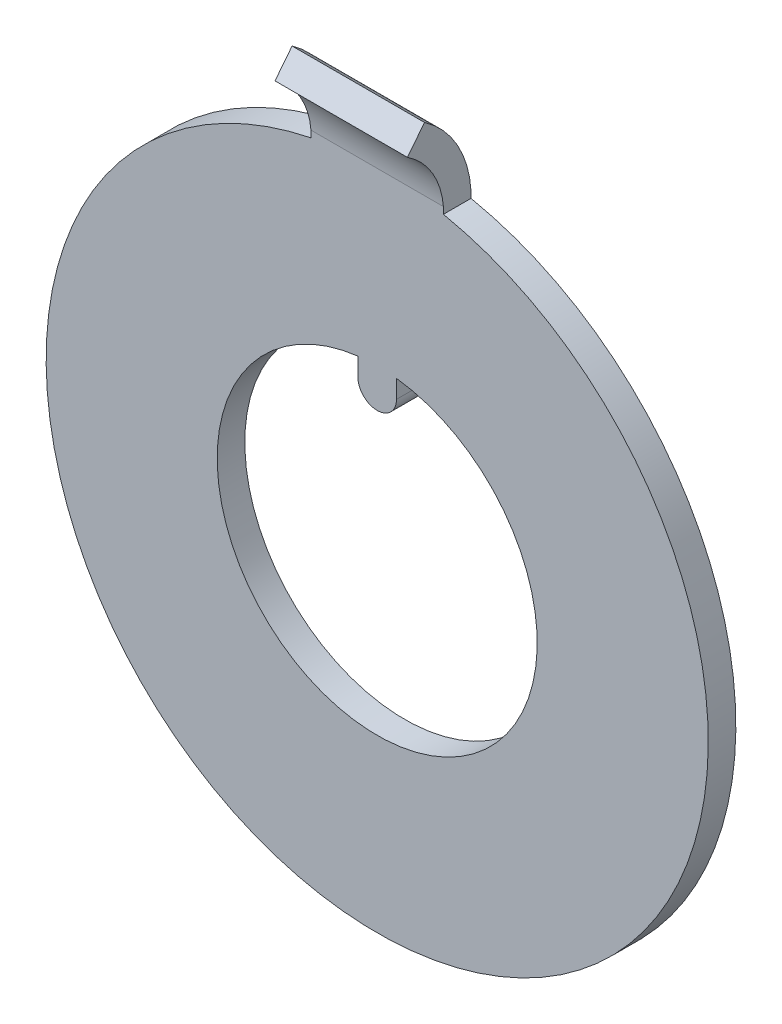
ISO-10303-21;
HEADER;
FILE_DESCRIPTION(('STEP AP214'),'2;1');
FILE_NAME('part.step','',(''),(''),'','','');
FILE_SCHEMA(('AUTOMOTIVE_DESIGN { 1 0 10303 214 1 1 1 1 }'));
ENDSEC;
DATA;
#1=APPLICATION_CONTEXT('core data for automotive mechanical design processes');
#2=APPLICATION_PROTOCOL_DEFINITION('international standard','automotive_design',2000,#1);
#3=PRODUCT_CONTEXT('',#1,'mechanical');
#4=PRODUCT('Part','Part','',(#3));
#5=PRODUCT_RELATED_PRODUCT_CATEGORY('part','',(#4));
#6=PRODUCT_DEFINITION_FORMATION('','',#4);
#7=PRODUCT_DEFINITION_CONTEXT('part definition',#1,'design');
#8=PRODUCT_DEFINITION('design','',#6,#7);
#9=PRODUCT_DEFINITION_SHAPE('','',#8);
#10=(LENGTH_UNIT() NAMED_UNIT(*) SI_UNIT(.MILLI.,.METRE.));
#11=(NAMED_UNIT(*) PLANE_ANGLE_UNIT() SI_UNIT($,.RADIAN.));
#12=(NAMED_UNIT(*) SI_UNIT($,.STERADIAN.) SOLID_ANGLE_UNIT());
#13=UNCERTAINTY_MEASURE_WITH_UNIT(LENGTH_MEASURE(1.E-05),#10,'distance_accuracy_value','');
#14=(GEOMETRIC_REPRESENTATION_CONTEXT(3) GLOBAL_UNCERTAINTY_ASSIGNED_CONTEXT((#13)) GLOBAL_UNIT_ASSIGNED_CONTEXT((#10,
#11,#12)) REPRESENTATION_CONTEXT('',''));
#15=CARTESIAN_POINT('',(0.,0.,0.));
#16=DIRECTION('',(0.,0.,1.));
#17=DIRECTION('',(1.,0.,0.));
#18=AXIS2_PLACEMENT_3D('',#15,#16,#17);
#19=CARTESIAN_POINT('',(-0.35,0.,0.5));
#20=DIRECTION('',(1.,0.,0.));
#21=DIRECTION('',(0.,1.,0.));
#22=AXIS2_PLACEMENT_3D('',#19,#20,#21);
#23=PLANE('',#22);
#24=DIRECTION('',(0.,-1.,0.));
#25=VECTOR('',#24,1.);
#26=CARTESIAN_POINT('',(-0.35,0.,0.));
#27=LINE('',#26,#25);
#28=CARTESIAN_POINT('',(-0.35,2.87880183409696,0.));
#29=VERTEX_POINT('',#28);
#30=CARTESIAN_POINT('',(-0.35,2.55,0.));
#31=VERTEX_POINT('',#30);
#32=EDGE_CURVE('E195',#29,#31,#27,.T.);
#33=ORIENTED_EDGE('',*,*,#32,.T.);
#34=DIRECTION('',(0.,0.,-1.));
#35=VECTOR('',#34,1.);
#36=CARTESIAN_POINT('',(-0.35,2.55,0.5));
#37=LINE('',#36,#35);
#38=CARTESIAN_POINT('',(-0.35,2.55,0.5));
#39=VERTEX_POINT('',#38);
#40=EDGE_CURVE('E11',#39,#31,#37,.T.);
#41=ORIENTED_EDGE('',*,*,#40,.F.);
#42=DIRECTION('',(0.,-1.,0.));
#43=VECTOR('',#42,1.);
#44=CARTESIAN_POINT('',(-0.35,0.,0.5));
#45=LINE('',#44,#43);
#46=CARTESIAN_POINT('',(-0.35,2.87880183409696,0.5));
#47=VERTEX_POINT('',#46);
#48=EDGE_CURVE('E196',#47,#39,#45,.T.);
#49=ORIENTED_EDGE('',*,*,#48,.F.);
#50=DIRECTION('',(0.,0.,-1.));
#51=VECTOR('',#50,1.);
#52=CARTESIAN_POINT('',(-0.35,2.87880183409696,0.5));
#53=LINE('',#52,#51);
#54=EDGE_CURVE('E65',#47,#29,#53,.T.);
#55=ORIENTED_EDGE('',*,*,#54,.T.);
#56=EDGE_LOOP('',(#33,#41,#49,#55));
#57=FACE_BOUND('',#56,.T.);
#58=ADVANCED_FACE('F41',(#57),#23,.F.);
#59=CARTESIAN_POINT('',(0.,2.55,0.5));
#60=DIRECTION('',(0.,0.,-1.));
#61=DIRECTION('',(-1.,0.,0.));
#62=AXIS2_PLACEMENT_3D('',#59,#60,#61);
#63=CYLINDRICAL_SURFACE('',#62,0.35);
#64=CARTESIAN_POINT('',(0.,2.55,0.));
#65=DIRECTION('',(0.,0.,1.));
#66=DIRECTION('',(1.,0.,0.));
#67=AXIS2_PLACEMENT_3D('',#64,#65,#66);
#68=CIRCLE('',#67,0.35);
#69=CARTESIAN_POINT('',(0.35,2.55,0.));
#70=VERTEX_POINT('',#69);
#71=EDGE_CURVE('E214',#31,#70,#68,.T.);
#72=ORIENTED_EDGE('',*,*,#71,.T.);
#73=DIRECTION('',(0.,0.,-1.));
#74=VECTOR('',#73,1.);
#75=CARTESIAN_POINT('',(0.35,2.55,0.5));
#76=LINE('',#75,#74);
#77=CARTESIAN_POINT('',(0.35,2.55,0.5));
#78=VERTEX_POINT('',#77);
#79=EDGE_CURVE('E49',#78,#70,#76,.T.);
#80=ORIENTED_EDGE('',*,*,#79,.F.);
#81=CARTESIAN_POINT('',(0.,2.55,0.5));
#82=DIRECTION('',(0.,0.,1.));
#83=DIRECTION('',(1.,0.,0.));
#84=AXIS2_PLACEMENT_3D('',#81,#82,#83);
#85=CIRCLE('',#84,0.35);
#86=EDGE_CURVE('E91',#39,#78,#85,.T.);
#87=ORIENTED_EDGE('',*,*,#86,.F.);
#88=ORIENTED_EDGE('',*,*,#40,.T.);
#89=EDGE_LOOP('',(#72,#80,#87,#88));
#90=FACE_BOUND('',#89,.T.);
#91=ADVANCED_FACE('F237',(#90),#63,.T.);
#92=CARTESIAN_POINT('',(0.35,0.,0.5));
#93=DIRECTION('',(1.,0.,0.));
#94=DIRECTION('',(0.,1.,0.));
#95=AXIS2_PLACEMENT_3D('',#92,#93,#94);
#96=PLANE('',#95);
#97=DIRECTION('',(0.,-1.,0.));
#98=VECTOR('',#97,1.);
#99=CARTESIAN_POINT('',(0.35,0.,0.));
#100=LINE('',#99,#98);
#101=CARTESIAN_POINT('',(0.35,2.87880183409696,0.));
#102=VERTEX_POINT('',#101);
#103=EDGE_CURVE('E218',#102,#70,#100,.T.);
#104=ORIENTED_EDGE('',*,*,#103,.F.);
#105=DIRECTION('',(0.,0.,-1.));
#106=VECTOR('',#105,1.);
#107=CARTESIAN_POINT('',(0.35,2.87880183409696,0.5));
#108=LINE('',#107,#106);
#109=CARTESIAN_POINT('',(0.35,2.87880183409696,0.5));
#110=VERTEX_POINT('',#109);
#111=EDGE_CURVE('E230',#110,#102,#108,.T.);
#112=ORIENTED_EDGE('',*,*,#111,.F.);
#113=DIRECTION('',(0.,-1.,0.));
#114=VECTOR('',#113,1.);
#115=CARTESIAN_POINT('',(0.35,0.,0.5));
#116=LINE('',#115,#114);
#117=EDGE_CURVE('E202',#110,#78,#116,.T.);
#118=ORIENTED_EDGE('',*,*,#117,.T.);
#119=ORIENTED_EDGE('',*,*,#79,.T.);
#120=EDGE_LOOP('',(#104,#112,#118,#119));
#121=FACE_BOUND('',#120,.T.);
#122=ADVANCED_FACE('F235',(#121),#96,.T.);
#123=CARTESIAN_POINT('',(0.,0.,0.5));
#124=DIRECTION('',(0.,0.,-1.));
#125=DIRECTION('',(-1.,0.,0.));
#126=AXIS2_PLACEMENT_3D('',#123,#124,#125);
#127=CYLINDRICAL_SURFACE('',#126,2.9);
#128=CARTESIAN_POINT('',(0.,0.,0.));
#129=DIRECTION('',(0.,0.,1.));
#130=DIRECTION('',(1.,0.,0.));
#131=AXIS2_PLACEMENT_3D('',#128,#129,#130);
#132=CIRCLE('',#131,2.9);
#133=EDGE_CURVE('E222',#29,#102,#132,.T.);
#134=ORIENTED_EDGE('',*,*,#133,.F.);
#135=ORIENTED_EDGE('',*,*,#54,.F.);
#136=CARTESIAN_POINT('',(0.,0.,0.5));
#137=DIRECTION('',(0.,0.,1.));
#138=DIRECTION('',(1.,0.,0.));
#139=AXIS2_PLACEMENT_3D('',#136,#137,#138);
#140=CIRCLE('',#139,2.9);
#141=EDGE_CURVE('E206',#47,#110,#140,.T.);
#142=ORIENTED_EDGE('',*,*,#141,.T.);
#143=ORIENTED_EDGE('',*,*,#111,.T.);
#144=EDGE_LOOP('',(#134,#135,#142,#143));
#145=FACE_BOUND('',#144,.T.);
#146=ADVANCED_FACE('F239',(#145),#127,.F.);
#147=CARTESIAN_POINT('',(0.,0.,0.5));
#148=DIRECTION('',(0.,0.,-1.));
#149=DIRECTION('',(-1.,0.,0.));
#150=AXIS2_PLACEMENT_3D('',#147,#148,#149);
#151=CYLINDRICAL_SURFACE('',#150,6.);
#152=CARTESIAN_POINT('',(0.,0.,0.5));
#153=DIRECTION('',(0.,0.,1.));
#154=DIRECTION('',(1.,0.,0.));
#155=AXIS2_PLACEMENT_3D('',#152,#153,#154);
#156=CIRCLE('',#155,6.);
#157=CARTESIAN_POINT('',(-1.2,5.87877538267963,0.5));
#158=VERTEX_POINT('',#157);
#159=CARTESIAN_POINT('',(1.2,5.87877538267963,0.5));
#160=VERTEX_POINT('',#159);
#161=EDGE_CURVE('E209',#158,#160,#156,.T.);
#162=ORIENTED_EDGE('',*,*,#161,.F.);
#163=DIRECTION('',(0.,0.,-1.));
#164=VECTOR('',#163,1.);
#165=CARTESIAN_POINT('',(-1.2,5.87877538267963,0.500000000000001));
#166=LINE('',#165,#164);
#167=CARTESIAN_POINT('',(-1.2,5.87877538267963,0.));
#168=VERTEX_POINT('',#167);
#169=EDGE_CURVE('E191',#158,#168,#166,.T.);
#170=ORIENTED_EDGE('',*,*,#169,.T.);
#171=CARTESIAN_POINT('',(0.,0.,0.));
#172=DIRECTION('',(0.,0.,1.));
#173=DIRECTION('',(1.,0.,0.));
#174=AXIS2_PLACEMENT_3D('',#171,#172,#173);
#175=CIRCLE('',#174,6.);
#176=CARTESIAN_POINT('',(1.2,5.87877538267963,0.));
#177=VERTEX_POINT('',#176);
#178=EDGE_CURVE('E199',#168,#177,#175,.T.);
#179=ORIENTED_EDGE('',*,*,#178,.T.);
#180=DIRECTION('',(0.,0.,-1.));
#181=VECTOR('',#180,1.);
#182=CARTESIAN_POINT('',(1.2,5.87877538267963,0.500000000000001));
#183=LINE('',#182,#181);
#184=EDGE_CURVE('E148',#177,#160,#183,.F.);
#185=ORIENTED_EDGE('',*,*,#184,.T.);
#186=EDGE_LOOP('',(#162,#170,#179,#185));
#187=FACE_BOUND('',#186,.T.);
#188=ADVANCED_FACE('F254',(#187),#151,.T.);
#189=CARTESIAN_POINT('',(0.,0.,0.5));
#190=DIRECTION('',(0.,0.,1.));
#191=DIRECTION('',(1.,0.,0.));
#192=AXIS2_PLACEMENT_3D('',#189,#190,#191);
#193=PLANE('',#192);
#194=ORIENTED_EDGE('',*,*,#161,.T.);
#195=DIRECTION('',(0.,1.,0.));
#196=VECTOR('',#195,1.);
#197=CARTESIAN_POINT('',(1.2,5.7,0.5));
#198=LINE('',#197,#196);
#199=CARTESIAN_POINT('',(1.2,6.,0.5));
#200=VERTEX_POINT('',#199);
#201=EDGE_CURVE('E150',#160,#200,#198,.T.);
#202=ORIENTED_EDGE('',*,*,#201,.T.);
#203=DIRECTION('',(1.,0.,0.));
#204=VECTOR('',#203,1.);
#205=CARTESIAN_POINT('',(1.2,6.,0.5));
#206=LINE('',#205,#204);
#207=CARTESIAN_POINT('',(-1.2,6.,0.5));
#208=VERTEX_POINT('',#207);
#209=EDGE_CURVE('E140',#208,#200,#206,.T.);
#210=ORIENTED_EDGE('',*,*,#209,.F.);
#211=DIRECTION('',(0.,1.,0.));
#212=VECTOR('',#211,1.);
#213=CARTESIAN_POINT('',(-1.2,5.7,0.5));
#214=LINE('',#213,#212);
#215=EDGE_CURVE('E56',#158,#208,#214,.T.);
#216=ORIENTED_EDGE('',*,*,#215,.F.);
#217=EDGE_LOOP('',(#194,#202,#210,#216));
#218=FACE_BOUND('',#217,.T.);
#219=ORIENTED_EDGE('',*,*,#48,.T.);
#220=ORIENTED_EDGE('',*,*,#86,.T.);
#221=ORIENTED_EDGE('',*,*,#117,.F.);
#222=ORIENTED_EDGE('',*,*,#141,.F.);
#223=EDGE_LOOP('',(#219,#220,#221,#222));
#224=FACE_BOUND('',#223,.T.);
#225=ADVANCED_FACE('F242',(#218,#224),#193,.T.);
#226=CARTESIAN_POINT('',(0.,0.,0.));
#227=DIRECTION('',(0.,0.,1.));
#228=DIRECTION('',(1.,0.,0.));
#229=AXIS2_PLACEMENT_3D('',#226,#227,#228);
#230=PLANE('',#229);
#231=ORIENTED_EDGE('',*,*,#178,.F.);
#232=DIRECTION('',(0.,1.,0.));
#233=VECTOR('',#232,1.);
#234=CARTESIAN_POINT('',(-1.2,5.7,0.));
#235=LINE('',#234,#233);
#236=CARTESIAN_POINT('',(-1.2,6.,0.));
#237=VERTEX_POINT('',#236);
#238=EDGE_CURVE('E134',#168,#237,#235,.T.);
#239=ORIENTED_EDGE('',*,*,#238,.T.);
#240=DIRECTION('',(-1.,0.,0.));
#241=VECTOR('',#240,1.);
#242=CARTESIAN_POINT('',(1.2,6.,0.));
#243=LINE('',#242,#241);
#244=CARTESIAN_POINT('',(1.2,6.,0.));
#245=VERTEX_POINT('',#244);
#246=EDGE_CURVE('E127',#245,#237,#243,.T.);
#247=ORIENTED_EDGE('',*,*,#246,.F.);
#248=DIRECTION('',(0.,1.,0.));
#249=VECTOR('',#248,1.);
#250=CARTESIAN_POINT('',(1.2,5.7,0.));
#251=LINE('',#250,#249);
#252=EDGE_CURVE('E132',#177,#245,#251,.T.);
#253=ORIENTED_EDGE('',*,*,#252,.F.);
#254=EDGE_LOOP('',(#231,#239,#247,#253));
#255=FACE_BOUND('',#254,.T.);
#256=ORIENTED_EDGE('',*,*,#32,.F.);
#257=ORIENTED_EDGE('',*,*,#133,.T.);
#258=ORIENTED_EDGE('',*,*,#103,.T.);
#259=ORIENTED_EDGE('',*,*,#71,.F.);
#260=EDGE_LOOP('',(#256,#257,#258,#259));
#261=FACE_BOUND('',#260,.T.);
#262=ADVANCED_FACE('F130',(#255,#261),#230,.F.);
#263=CARTESIAN_POINT('',(-1.2,5.7,0.5));
#264=DIRECTION('',(-1.,0.,0.));
#265=DIRECTION('',(0.,0.,1.));
#266=AXIS2_PLACEMENT_3D('',#263,#264,#265);
#267=PLANE('',#266);
#268=ORIENTED_EDGE('',*,*,#169,.F.);
#269=ORIENTED_EDGE('',*,*,#215,.T.);
#270=CARTESIAN_POINT('',(-1.2,5.87877538267963,1.95666666666667));
#271=DIRECTION('',(1.,0.,0.));
#272=DIRECTION('',(0.,0.0829338706438632,-0.996555052719129));
#273=AXIS2_PLACEMENT_3D('',#270,#271,#272);
#274=CIRCLE('',#273,1.4617021535259);
#275=CARTESIAN_POINT('',(-1.2,7.09894012140805,1.15182432434982));
#276=VERTEX_POINT('',#275);
#277=EDGE_CURVE('E173',#208,#276,#274,.T.);
#278=ORIENTED_EDGE('',*,*,#277,.T.);
#279=DIRECTION('',(0.,-0.786215332618204,0.617952628245925));
#280=VECTOR('',#279,1.);
#281=CARTESIAN_POINT('',(-1.2,7.09894012140805,1.15182432434982));
#282=LINE('',#281,#280);
#283=CARTESIAN_POINT('',(-1.2,7.49204778771715,0.842848010226859));
#284=VERTEX_POINT('',#283);
#285=EDGE_CURVE('E170',#284,#276,#282,.T.);
#286=ORIENTED_EDGE('',*,*,#285,.F.);
#287=CARTESIAN_POINT('',(-1.2,5.87877538267963,1.95666666666667));
#288=DIRECTION('',(1.,0.,0.));
#289=DIRECTION('',(0.,0.0618360980643358,-0.998086317397537));
#290=AXIS2_PLACEMENT_3D('',#287,#288,#289);
#291=CIRCLE('',#290,1.96041828503228);
#292=EDGE_CURVE('E160',#237,#284,#291,.T.);
#293=ORIENTED_EDGE('',*,*,#292,.F.);
#294=ORIENTED_EDGE('',*,*,#238,.F.);
#295=EDGE_LOOP('',(#268,#269,#278,#286,#293,#294));
#296=FACE_BOUND('',#295,.T.);
#297=ADVANCED_FACE('F260',(#296),#267,.T.);
#298=CARTESIAN_POINT('',(1.2,5.7,0.5));
#299=DIRECTION('',(1.,0.,0.));
#300=DIRECTION('',(0.,0.,-1.));
#301=AXIS2_PLACEMENT_3D('',#298,#299,#300);
#302=PLANE('',#301);
#303=ORIENTED_EDGE('',*,*,#184,.F.);
#304=ORIENTED_EDGE('',*,*,#252,.T.);
#305=CARTESIAN_POINT('',(1.2,5.87877538267963,1.95666666666667));
#306=DIRECTION('',(1.,0.,0.));
#307=DIRECTION('',(0.,0.0618360980643358,-0.998086317397537));
#308=AXIS2_PLACEMENT_3D('',#305,#306,#307);
#309=CIRCLE('',#308,1.96041828503228);
#310=CARTESIAN_POINT('',(1.2,7.49204778771715,0.842848010226859));
#311=VERTEX_POINT('',#310);
#312=EDGE_CURVE('E146',#245,#311,#309,.T.);
#313=ORIENTED_EDGE('',*,*,#312,.T.);
#314=DIRECTION('',(0.,0.786215332618204,-0.617952628245925));
#315=VECTOR('',#314,1.);
#316=CARTESIAN_POINT('',(1.2,7.09894012140805,1.15182432434982));
#317=LINE('',#316,#315);
#318=CARTESIAN_POINT('',(1.2,7.09894012140805,1.15182432434982));
#319=VERTEX_POINT('',#318);
#320=EDGE_CURVE('E156',#319,#311,#317,.T.);
#321=ORIENTED_EDGE('',*,*,#320,.F.);
#322=CARTESIAN_POINT('',(1.2,5.87877538267963,1.95666666666667));
#323=DIRECTION('',(1.,0.,0.));
#324=DIRECTION('',(0.,0.0829338706438632,-0.996555052719129));
#325=AXIS2_PLACEMENT_3D('',#322,#323,#324);
#326=CIRCLE('',#325,1.4617021535259);
#327=EDGE_CURVE('E162',#200,#319,#326,.T.);
#328=ORIENTED_EDGE('',*,*,#327,.F.);
#329=ORIENTED_EDGE('',*,*,#201,.F.);
#330=EDGE_LOOP('',(#303,#304,#313,#321,#328,#329));
#331=FACE_BOUND('',#330,.T.);
#332=ADVANCED_FACE('F144',(#331),#302,.T.);
#333=CARTESIAN_POINT('',(0.,7.49204778771715,0.84284801022686));
#334=DIRECTION('',(0.,0.617952628245925,0.786215332618204));
#335=DIRECTION('',(0.,-0.786215332618204,0.617952628245925));
#336=AXIS2_PLACEMENT_3D('',#333,#334,#335);
#337=PLANE('',#336);
#338=ORIENTED_EDGE('',*,*,#285,.T.);
#339=DIRECTION('',(1.,0.,0.));
#340=VECTOR('',#339,1.);
#341=CARTESIAN_POINT('',(1.2,7.09894012140805,1.15182432434982));
#342=LINE('',#341,#340);
#343=EDGE_CURVE('E177',#276,#319,#342,.T.);
#344=ORIENTED_EDGE('',*,*,#343,.T.);
#345=ORIENTED_EDGE('',*,*,#320,.T.);
#346=DIRECTION('',(-1.,0.,0.));
#347=VECTOR('',#346,1.);
#348=CARTESIAN_POINT('',(1.2,7.49204778771715,0.84284801022686));
#349=LINE('',#348,#347);
#350=EDGE_CURVE('E154',#311,#284,#349,.T.);
#351=ORIENTED_EDGE('',*,*,#350,.T.);
#352=EDGE_LOOP('',(#338,#344,#345,#351));
#353=FACE_BOUND('',#352,.T.);
#354=ADVANCED_FACE('F268',(#353),#337,.T.);
#355=CARTESIAN_POINT('',(0.,5.87877538267963,1.95666666666667));
#356=DIRECTION('',(1.,0.,0.));
#357=DIRECTION('',(0.,0.,-1.));
#358=AXIS2_PLACEMENT_3D('',#355,#356,#357);
#359=CYLINDRICAL_SURFACE('',#358,1.96041828503228);
#360=ORIENTED_EDGE('',*,*,#292,.T.);
#361=ORIENTED_EDGE('',*,*,#350,.F.);
#362=ORIENTED_EDGE('',*,*,#312,.F.);
#363=ORIENTED_EDGE('',*,*,#246,.T.);
#364=EDGE_LOOP('',(#360,#361,#362,#363));
#365=FACE_BOUND('',#364,.T.);
#366=ADVANCED_FACE('F153',(#365),#359,.T.);
#367=CARTESIAN_POINT('',(0.,5.87877538267963,1.95666666666667));
#368=DIRECTION('',(1.,0.,0.));
#369=DIRECTION('',(0.,0.,-1.));
#370=AXIS2_PLACEMENT_3D('',#367,#368,#369);
#371=CYLINDRICAL_SURFACE('',#370,1.4617021535259);
#372=ORIENTED_EDGE('',*,*,#343,.F.);
#373=ORIENTED_EDGE('',*,*,#277,.F.);
#374=ORIENTED_EDGE('',*,*,#209,.T.);
#375=ORIENTED_EDGE('',*,*,#327,.T.);
#376=EDGE_LOOP('',(#372,#373,#374,#375));
#377=FACE_BOUND('',#376,.T.);
#378=ADVANCED_FACE('F269',(#377),#371,.F.);
#379=CLOSED_SHELL('',(#58,#91,#122,#146,#188,#225,#262,#297,#332,#354,#366,#378));
#380=MANIFOLD_SOLID_BREP('B2',#379);
#381=ADVANCED_BREP_SHAPE_REPRESENTATION('',(#18,#380),#14);
#382=SHAPE_DEFINITION_REPRESENTATION(#9,#381);
ENDSEC;
END-ISO-10303-21;
